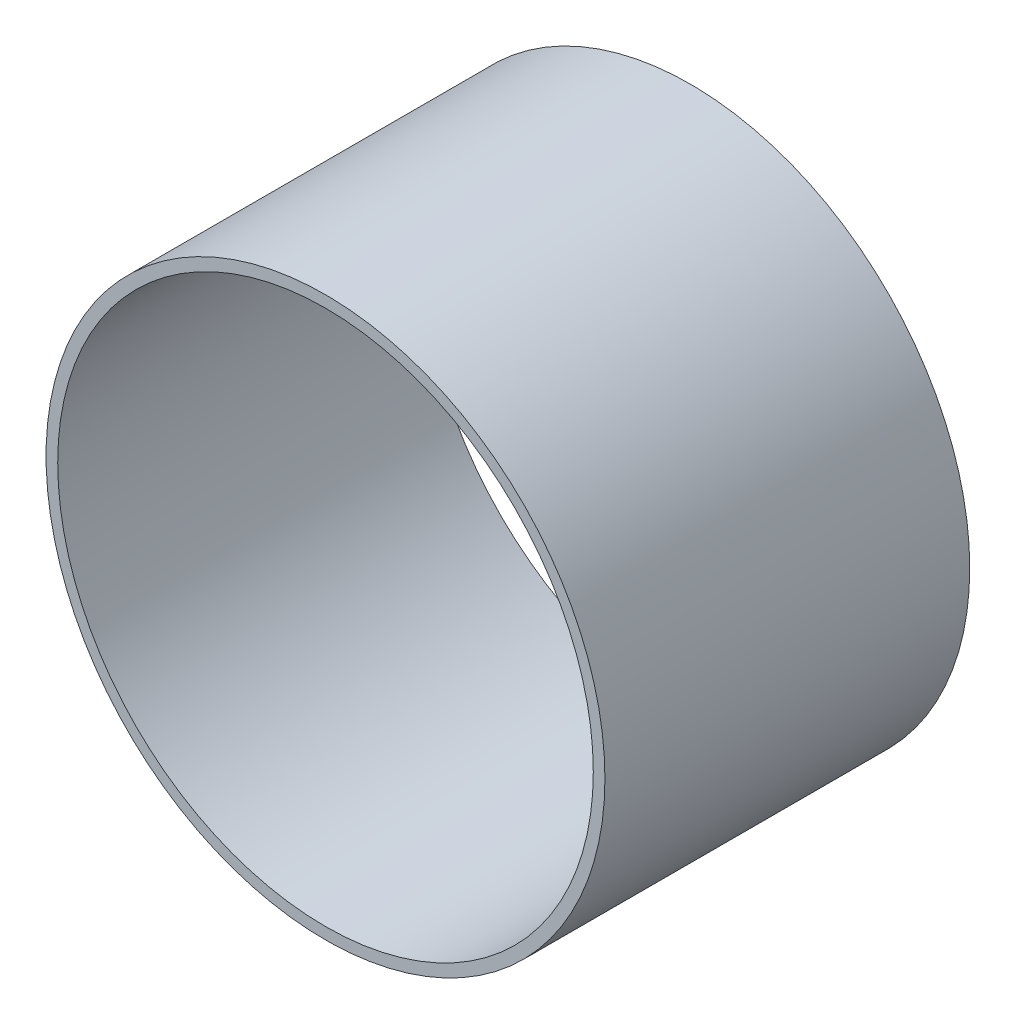
ISO-10303-21;
HEADER;
FILE_DESCRIPTION(('STEP AP214'),'2;1');
FILE_NAME('part.step','',(''),(''),'','','');
FILE_SCHEMA(('AUTOMOTIVE_DESIGN { 1 0 10303 214 1 1 1 1 }'));
ENDSEC;
DATA;
#1=APPLICATION_CONTEXT('core data for automotive mechanical design processes');
#2=APPLICATION_PROTOCOL_DEFINITION('international standard','automotive_design',2000,#1);
#3=PRODUCT_CONTEXT('',#1,'mechanical');
#4=PRODUCT('Part','Part','',(#3));
#5=PRODUCT_RELATED_PRODUCT_CATEGORY('part','',(#4));
#6=PRODUCT_DEFINITION_FORMATION('','',#4);
#7=PRODUCT_DEFINITION_CONTEXT('part definition',#1,'design');
#8=PRODUCT_DEFINITION('design','',#6,#7);
#9=PRODUCT_DEFINITION_SHAPE('','',#8);
#10=(LENGTH_UNIT() NAMED_UNIT(*) SI_UNIT(.MILLI.,.METRE.));
#11=(NAMED_UNIT(*) PLANE_ANGLE_UNIT() SI_UNIT($,.RADIAN.));
#12=(NAMED_UNIT(*) SI_UNIT($,.STERADIAN.) SOLID_ANGLE_UNIT());
#13=UNCERTAINTY_MEASURE_WITH_UNIT(LENGTH_MEASURE(1.E-05),#10,'distance_accuracy_value','');
#14=(GEOMETRIC_REPRESENTATION_CONTEXT(3) GLOBAL_UNCERTAINTY_ASSIGNED_CONTEXT((#13)) GLOBAL_UNIT_ASSIGNED_CONTEXT((#10,
#11,#12)) REPRESENTATION_CONTEXT('',''));
#15=CARTESIAN_POINT('',(0.,0.,0.));
#16=DIRECTION('',(0.,0.,1.));
#17=DIRECTION('',(1.,0.,0.));
#18=AXIS2_PLACEMENT_3D('',#15,#16,#17);
#19=CARTESIAN_POINT('',(0.,0.,74.6125));
#20=DIRECTION('',(0.,0.,1.));
#21=DIRECTION('',(1.,0.,0.));
#22=AXIS2_PLACEMENT_3D('',#19,#20,#21);
#23=PLANE('',#22);
#24=CARTESIAN_POINT('',(0.,0.,74.6125));
#25=DIRECTION('',(0.,0.,1.));
#26=DIRECTION('',(1.,0.,0.));
#27=AXIS2_PLACEMENT_3D('',#24,#25,#26);
#28=CIRCLE('',#27,114.3);
#29=CARTESIAN_POINT('',(114.3,0.,74.6125));
#30=VERTEX_POINT('',#29);
#31=EDGE_CURVE('E10',#30,#30,#28,.T.);
#32=ORIENTED_EDGE('',*,*,#31,.T.);
#33=EDGE_LOOP('',(#32));
#34=FACE_BOUND('',#33,.T.);
#35=CARTESIAN_POINT('',(0.,0.,74.6125));
#36=DIRECTION('',(0.,0.,1.));
#37=DIRECTION('',(1.,0.,0.));
#38=AXIS2_PLACEMENT_3D('',#35,#36,#37);
#39=CIRCLE('',#38,109.5375);
#40=CARTESIAN_POINT('',(109.5375,0.,74.6125));
#41=VERTEX_POINT('',#40);
#42=EDGE_CURVE('E43',#41,#41,#39,.T.);
#43=ORIENTED_EDGE('',*,*,#42,.F.);
#44=EDGE_LOOP('',(#43));
#45=FACE_BOUND('',#44,.T.);
#46=ADVANCED_FACE('F32',(#34,#45),#23,.T.);
#47=CARTESIAN_POINT('',(0.,0.,-74.6125));
#48=DIRECTION('',(0.,0.,1.));
#49=DIRECTION('',(1.,0.,0.));
#50=AXIS2_PLACEMENT_3D('',#47,#48,#49);
#51=PLANE('',#50);
#52=CARTESIAN_POINT('',(0.,0.,-74.6125));
#53=DIRECTION('',(0.,0.,1.));
#54=DIRECTION('',(1.,0.,0.));
#55=AXIS2_PLACEMENT_3D('',#52,#53,#54);
#56=CIRCLE('',#55,114.3);
#57=CARTESIAN_POINT('',(114.3,0.,-74.6125));
#58=VERTEX_POINT('',#57);
#59=EDGE_CURVE('E36',#58,#58,#56,.T.);
#60=ORIENTED_EDGE('',*,*,#59,.F.);
#61=EDGE_LOOP('',(#60));
#62=FACE_BOUND('',#61,.T.);
#63=CARTESIAN_POINT('',(0.,0.,-74.6125));
#64=DIRECTION('',(0.,0.,1.));
#65=DIRECTION('',(1.,0.,0.));
#66=AXIS2_PLACEMENT_3D('',#63,#64,#65);
#67=CIRCLE('',#66,109.5375);
#68=CARTESIAN_POINT('',(109.5375,0.,-74.6125));
#69=VERTEX_POINT('',#68);
#70=EDGE_CURVE('E45',#69,#69,#67,.T.);
#71=ORIENTED_EDGE('',*,*,#70,.T.);
#72=EDGE_LOOP('',(#71));
#73=FACE_BOUND('',#72,.T.);
#74=ADVANCED_FACE('F55',(#62,#73),#51,.F.);
#75=CARTESIAN_POINT('',(0.,0.,74.6125));
#76=DIRECTION('',(0.,0.,-1.));
#77=DIRECTION('',(-1.,0.,0.));
#78=AXIS2_PLACEMENT_3D('',#75,#76,#77);
#79=CYLINDRICAL_SURFACE('',#78,114.3);
#80=ORIENTED_EDGE('',*,*,#31,.F.);
#81=EDGE_LOOP('',(#80));
#82=FACE_BOUND('',#81,.T.);
#83=ORIENTED_EDGE('',*,*,#59,.T.);
#84=EDGE_LOOP('',(#83));
#85=FACE_BOUND('',#84,.T.);
#86=ADVANCED_FACE('F34',(#82,#85),#79,.T.);
#87=CARTESIAN_POINT('',(0.,0.,74.6125));
#88=DIRECTION('',(0.,0.,-1.));
#89=DIRECTION('',(-1.,0.,0.));
#90=AXIS2_PLACEMENT_3D('',#87,#88,#89);
#91=CYLINDRICAL_SURFACE('',#90,109.5375);
#92=ORIENTED_EDGE('',*,*,#42,.T.);
#93=EDGE_LOOP('',(#92));
#94=FACE_BOUND('',#93,.T.);
#95=ORIENTED_EDGE('',*,*,#70,.F.);
#96=EDGE_LOOP('',(#95));
#97=FACE_BOUND('',#96,.T.);
#98=ADVANCED_FACE('F51',(#94,#97),#91,.F.);
#99=CLOSED_SHELL('',(#46,#74,#86,#98));
#100=MANIFOLD_SOLID_BREP('B2',#99);
#101=ADVANCED_BREP_SHAPE_REPRESENTATION('',(#18,#100),#14);
#102=SHAPE_DEFINITION_REPRESENTATION(#9,#101);
ENDSEC;
END-ISO-10303-21;
